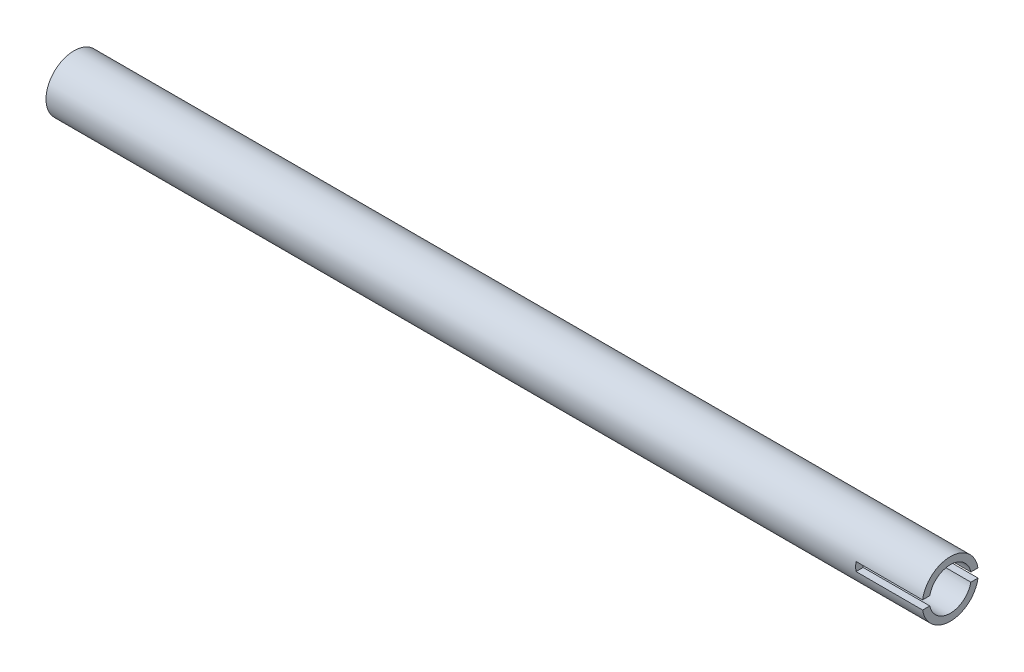
ISO-10303-21;
HEADER;
FILE_DESCRIPTION(('STEP AP214'),'2;1');
FILE_NAME('part.step','',(''),(''),'','','');
FILE_SCHEMA(('AUTOMOTIVE_DESIGN { 1 0 10303 214 1 1 1 1 }'));
ENDSEC;
DATA;
#1=APPLICATION_CONTEXT('core data for automotive mechanical design processes');
#2=APPLICATION_PROTOCOL_DEFINITION('international standard','automotive_design',2000,#1);
#3=PRODUCT_CONTEXT('',#1,'mechanical');
#4=PRODUCT('Part','Part','',(#3));
#5=PRODUCT_RELATED_PRODUCT_CATEGORY('part','',(#4));
#6=PRODUCT_DEFINITION_FORMATION('','',#4);
#7=PRODUCT_DEFINITION_CONTEXT('part definition',#1,'design');
#8=PRODUCT_DEFINITION('design','',#6,#7);
#9=PRODUCT_DEFINITION_SHAPE('','',#8);
#10=(LENGTH_UNIT() NAMED_UNIT(*) SI_UNIT(.MILLI.,.METRE.));
#11=(NAMED_UNIT(*) PLANE_ANGLE_UNIT() SI_UNIT($,.RADIAN.));
#12=(NAMED_UNIT(*) SI_UNIT($,.STERADIAN.) SOLID_ANGLE_UNIT());
#13=UNCERTAINTY_MEASURE_WITH_UNIT(LENGTH_MEASURE(1.E-05),#10,'distance_accuracy_value','');
#14=(GEOMETRIC_REPRESENTATION_CONTEXT(3) GLOBAL_UNCERTAINTY_ASSIGNED_CONTEXT((#13)) GLOBAL_UNIT_ASSIGNED_CONTEXT((#10,
#11,#12)) REPRESENTATION_CONTEXT('',''));
#15=CARTESIAN_POINT('',(0.,0.,0.));
#16=DIRECTION('',(0.,0.,1.));
#17=DIRECTION('',(1.,0.,0.));
#18=AXIS2_PLACEMENT_3D('',#15,#16,#17);
#19=CARTESIAN_POINT('',(125.,0.,0.));
#20=DIRECTION('',(1.,0.,0.));
#21=DIRECTION('',(0.,0.,-1.));
#22=AXIS2_PLACEMENT_3D('',#19,#20,#21);
#23=PLANE('',#22);
#24=DIRECTION('',(0.,0.,1.));
#25=VECTOR('',#24,1.);
#26=CARTESIAN_POINT('',(125.,-1.25,-8.));
#27=LINE('',#26,#25);
#28=CARTESIAN_POINT('',(125.,-1.25,5.86834729715275));
#29=VERTEX_POINT('',#28);
#30=CARTESIAN_POINT('',(125.,-1.25,7.90174031463955));
#31=VERTEX_POINT('',#30);
#32=EDGE_CURVE('E161',#29,#31,#27,.T.);
#33=ORIENTED_EDGE('',*,*,#32,.T.);
#34=CARTESIAN_POINT('',(125.,0.,0.));
#35=DIRECTION('',(1.,0.,0.));
#36=DIRECTION('',(0.,0.,-1.));
#37=AXIS2_PLACEMENT_3D('',#34,#35,#36);
#38=CIRCLE('',#37,8.);
#39=CARTESIAN_POINT('',(125.,-1.25,-7.90174031463955));
#40=VERTEX_POINT('',#39);
#41=EDGE_CURVE('E146',#31,#40,#38,.T.);
#42=ORIENTED_EDGE('',*,*,#41,.T.);
#43=CARTESIAN_POINT('',(125.,-1.25,-5.86834729715275));
#44=VERTEX_POINT('',#43);
#45=EDGE_CURVE('E130',#40,#44,#27,.T.);
#46=ORIENTED_EDGE('',*,*,#45,.T.);
#47=CARTESIAN_POINT('',(125.,0.,0.));
#48=DIRECTION('',(1.,0.,0.));
#49=DIRECTION('',(0.,0.,-1.));
#50=AXIS2_PLACEMENT_3D('',#47,#48,#49);
#51=CIRCLE('',#50,6.);
#52=EDGE_CURVE('E143',#29,#44,#51,.T.);
#53=ORIENTED_EDGE('',*,*,#52,.F.);
#54=EDGE_LOOP('',(#33,#42,#46,#53));
#55=FACE_BOUND('',#54,.T.);
#56=ADVANCED_FACE('F39',(#55),#23,.T.);
#57=DIRECTION('',(0.,0.,1.));
#58=VECTOR('',#57,1.);
#59=CARTESIAN_POINT('',(125.,1.25,-8.));
#60=LINE('',#59,#58);
#61=CARTESIAN_POINT('',(125.,1.25,-7.90174031463955));
#62=VERTEX_POINT('',#61);
#63=CARTESIAN_POINT('',(125.,1.25,-5.86834729715275));
#64=VERTEX_POINT('',#63);
#65=EDGE_CURVE('E62',#62,#64,#60,.T.);
#66=ORIENTED_EDGE('',*,*,#65,.F.);
#67=CARTESIAN_POINT('',(125.,1.25,7.90174031463955));
#68=VERTEX_POINT('',#67);
#69=EDGE_CURVE('E127',#62,#68,#38,.T.);
#70=ORIENTED_EDGE('',*,*,#69,.T.);
#71=CARTESIAN_POINT('',(125.,1.25,5.86834729715275));
#72=VERTEX_POINT('',#71);
#73=EDGE_CURVE('E174',#72,#68,#60,.T.);
#74=ORIENTED_EDGE('',*,*,#73,.F.);
#75=EDGE_CURVE('E139',#64,#72,#51,.T.);
#76=ORIENTED_EDGE('',*,*,#75,.F.);
#77=EDGE_LOOP('',(#66,#70,#74,#76));
#78=FACE_BOUND('',#77,.T.);
#79=ADVANCED_FACE('F180',(#78),#23,.T.);
#80=CARTESIAN_POINT('',(-125.,0.,0.));
#81=DIRECTION('',(1.,0.,0.));
#82=DIRECTION('',(0.,0.,-1.));
#83=AXIS2_PLACEMENT_3D('',#80,#81,#82);
#84=PLANE('',#83);
#85=CARTESIAN_POINT('',(-125.,0.,0.));
#86=DIRECTION('',(1.,0.,0.));
#87=DIRECTION('',(0.,0.,-1.));
#88=AXIS2_PLACEMENT_3D('',#85,#86,#87);
#89=CIRCLE('',#88,8.);
#90=CARTESIAN_POINT('',(-125.,0.,-8.));
#91=VERTEX_POINT('',#90);
#92=EDGE_CURVE('E142',#91,#91,#89,.T.);
#93=ORIENTED_EDGE('',*,*,#92,.F.);
#94=EDGE_LOOP('',(#93));
#95=FACE_BOUND('',#94,.T.);
#96=CARTESIAN_POINT('',(-125.,0.,0.));
#97=DIRECTION('',(1.,0.,0.));
#98=DIRECTION('',(0.,0.,-1.));
#99=AXIS2_PLACEMENT_3D('',#96,#97,#98);
#100=CIRCLE('',#99,6.);
#101=CARTESIAN_POINT('',(-125.,0.,-6.));
#102=VERTEX_POINT('',#101);
#103=EDGE_CURVE('E138',#102,#102,#100,.T.);
#104=ORIENTED_EDGE('',*,*,#103,.T.);
#105=EDGE_LOOP('',(#104));
#106=FACE_BOUND('',#105,.T.);
#107=ADVANCED_FACE('F199',(#95,#106),#84,.F.);
#108=CARTESIAN_POINT('',(125.,0.,0.));
#109=DIRECTION('',(-1.,0.,0.));
#110=DIRECTION('',(0.,0.,1.));
#111=AXIS2_PLACEMENT_3D('',#108,#109,#110);
#112=CYLINDRICAL_SURFACE('',#111,8.);
#113=DIRECTION('',(-1.,0.,0.));
#114=VECTOR('',#113,1.);
#115=CARTESIAN_POINT('',(125.,1.25,-7.90174031463955));
#116=LINE('',#115,#114);
#117=CARTESIAN_POINT('',(106.,1.25,-7.90174031463955));
#118=VERTEX_POINT('',#117);
#119=EDGE_CURVE('E119',#62,#118,#116,.T.);
#120=ORIENTED_EDGE('',*,*,#119,.T.);
#121=CARTESIAN_POINT('',(106.,0.,0.));
#122=DIRECTION('',(-1.,0.,0.));
#123=DIRECTION('',(0.,0.,1.));
#124=AXIS2_PLACEMENT_3D('',#121,#122,#123);
#125=CIRCLE('',#124,8.);
#126=CARTESIAN_POINT('',(106.,-1.25,-7.90174031463955));
#127=VERTEX_POINT('',#126);
#128=EDGE_CURVE('E104',#118,#127,#125,.T.);
#129=ORIENTED_EDGE('',*,*,#128,.T.);
#130=DIRECTION('',(-1.,0.,0.));
#131=VECTOR('',#130,1.);
#132=CARTESIAN_POINT('',(125.,-1.25,-7.90174031463955));
#133=LINE('',#132,#131);
#134=EDGE_CURVE('E115',#127,#40,#133,.F.);
#135=ORIENTED_EDGE('',*,*,#134,.T.);
#136=ORIENTED_EDGE('',*,*,#41,.F.);
#137=DIRECTION('',(-1.,0.,0.));
#138=VECTOR('',#137,1.);
#139=CARTESIAN_POINT('',(125.,-1.25,7.90174031463955));
#140=LINE('',#139,#138);
#141=CARTESIAN_POINT('',(106.,-1.25,7.90174031463955));
#142=VERTEX_POINT('',#141);
#143=EDGE_CURVE('E135',#31,#142,#140,.T.);
#144=ORIENTED_EDGE('',*,*,#143,.T.);
#145=CARTESIAN_POINT('',(106.,1.25,7.90174031463955));
#146=VERTEX_POINT('',#145);
#147=EDGE_CURVE('E116',#142,#146,#125,.T.);
#148=ORIENTED_EDGE('',*,*,#147,.T.);
#149=DIRECTION('',(-1.,0.,0.));
#150=VECTOR('',#149,1.);
#151=CARTESIAN_POINT('',(125.,1.25,7.90174031463955));
#152=LINE('',#151,#150);
#153=EDGE_CURVE('E128',#146,#68,#152,.F.);
#154=ORIENTED_EDGE('',*,*,#153,.T.);
#155=ORIENTED_EDGE('',*,*,#69,.F.);
#156=EDGE_LOOP('',(#120,#129,#135,#136,#144,#148,#154,#155));
#157=FACE_BOUND('',#156,.T.);
#158=ORIENTED_EDGE('',*,*,#92,.T.);
#159=EDGE_LOOP('',(#158));
#160=FACE_BOUND('',#159,.T.);
#161=ADVANCED_FACE('F41',(#157,#160),#112,.T.);
#162=CARTESIAN_POINT('',(125.,0.,0.));
#163=DIRECTION('',(-1.,0.,0.));
#164=DIRECTION('',(0.,0.,1.));
#165=AXIS2_PLACEMENT_3D('',#162,#163,#164);
#166=CYLINDRICAL_SURFACE('',#165,6.);
#167=DIRECTION('',(-1.,0.,0.));
#168=VECTOR('',#167,1.);
#169=CARTESIAN_POINT('',(125.,-1.25,-5.86834729715275));
#170=LINE('',#169,#168);
#171=CARTESIAN_POINT('',(106.,-1.25,-5.86834729715275));
#172=VERTEX_POINT('',#171);
#173=EDGE_CURVE('E11',#172,#44,#170,.F.);
#174=ORIENTED_EDGE('',*,*,#173,.F.);
#175=CARTESIAN_POINT('',(106.,0.,0.));
#176=DIRECTION('',(-1.,0.,0.));
#177=DIRECTION('',(0.,0.,1.));
#178=AXIS2_PLACEMENT_3D('',#175,#176,#177);
#179=CIRCLE('',#178,6.);
#180=CARTESIAN_POINT('',(106.,1.25,-5.86834729715275));
#181=VERTEX_POINT('',#180);
#182=EDGE_CURVE('E47',#181,#172,#179,.T.);
#183=ORIENTED_EDGE('',*,*,#182,.F.);
#184=DIRECTION('',(-1.,0.,0.));
#185=VECTOR('',#184,1.);
#186=CARTESIAN_POINT('',(125.,1.25,-5.86834729715275));
#187=LINE('',#186,#185);
#188=EDGE_CURVE('E120',#64,#181,#187,.T.);
#189=ORIENTED_EDGE('',*,*,#188,.F.);
#190=ORIENTED_EDGE('',*,*,#75,.T.);
#191=DIRECTION('',(-1.,0.,0.));
#192=VECTOR('',#191,1.);
#193=CARTESIAN_POINT('',(125.,1.25,5.86834729715275));
#194=LINE('',#193,#192);
#195=CARTESIAN_POINT('',(106.,1.25,5.86834729715275));
#196=VERTEX_POINT('',#195);
#197=EDGE_CURVE('E151',#196,#72,#194,.F.);
#198=ORIENTED_EDGE('',*,*,#197,.F.);
#199=CARTESIAN_POINT('',(106.,-1.25,5.86834729715275));
#200=VERTEX_POINT('',#199);
#201=EDGE_CURVE('E153',#200,#196,#179,.T.);
#202=ORIENTED_EDGE('',*,*,#201,.F.);
#203=DIRECTION('',(-1.,0.,0.));
#204=VECTOR('',#203,1.);
#205=CARTESIAN_POINT('',(125.,-1.25,5.86834729715275));
#206=LINE('',#205,#204);
#207=EDGE_CURVE('E155',#29,#200,#206,.T.);
#208=ORIENTED_EDGE('',*,*,#207,.F.);
#209=ORIENTED_EDGE('',*,*,#52,.T.);
#210=EDGE_LOOP('',(#174,#183,#189,#190,#198,#202,#208,#209));
#211=FACE_BOUND('',#210,.T.);
#212=ORIENTED_EDGE('',*,*,#103,.F.);
#213=EDGE_LOOP('',(#212));
#214=FACE_BOUND('',#213,.T.);
#215=ADVANCED_FACE('F164',(#211,#214),#166,.F.);
#216=CARTESIAN_POINT('',(125.,1.25,-8.));
#217=DIRECTION('',(0.,1.,0.));
#218=DIRECTION('',(-1.,0.,0.));
#219=AXIS2_PLACEMENT_3D('',#216,#217,#218);
#220=PLANE('',#219);
#221=DIRECTION('',(0.,0.,1.));
#222=VECTOR('',#221,1.);
#223=CARTESIAN_POINT('',(106.,1.25,-8.));
#224=LINE('',#223,#222);
#225=EDGE_CURVE('E54',#196,#146,#224,.T.);
#226=ORIENTED_EDGE('',*,*,#225,.F.);
#227=ORIENTED_EDGE('',*,*,#197,.T.);
#228=ORIENTED_EDGE('',*,*,#73,.T.);
#229=ORIENTED_EDGE('',*,*,#153,.F.);
#230=EDGE_LOOP('',(#226,#227,#228,#229));
#231=FACE_BOUND('',#230,.T.);
#232=ADVANCED_FACE('F176',(#231),#220,.F.);
#233=CARTESIAN_POINT('',(106.,1.25,-8.));
#234=DIRECTION('',(-1.,0.,0.));
#235=DIRECTION('',(0.,0.,1.));
#236=AXIS2_PLACEMENT_3D('',#233,#234,#235);
#237=PLANE('',#236);
#238=ORIENTED_EDGE('',*,*,#147,.F.);
#239=DIRECTION('',(0.,0.,1.));
#240=VECTOR('',#239,1.);
#241=CARTESIAN_POINT('',(106.,-1.25,-8.));
#242=LINE('',#241,#240);
#243=EDGE_CURVE('E121',#200,#142,#242,.T.);
#244=ORIENTED_EDGE('',*,*,#243,.F.);
#245=ORIENTED_EDGE('',*,*,#201,.T.);
#246=ORIENTED_EDGE('',*,*,#225,.T.);
#247=EDGE_LOOP('',(#238,#244,#245,#246));
#248=FACE_BOUND('',#247,.T.);
#249=ADVANCED_FACE('F183',(#248),#237,.F.);
#250=CARTESIAN_POINT('',(125.,-1.25,-8.));
#251=DIRECTION('',(0.,-1.,0.));
#252=DIRECTION('',(1.,0.,0.));
#253=AXIS2_PLACEMENT_3D('',#250,#251,#252);
#254=PLANE('',#253);
#255=ORIENTED_EDGE('',*,*,#32,.F.);
#256=ORIENTED_EDGE('',*,*,#207,.T.);
#257=ORIENTED_EDGE('',*,*,#243,.T.);
#258=ORIENTED_EDGE('',*,*,#143,.F.);
#259=EDGE_LOOP('',(#255,#256,#257,#258));
#260=FACE_BOUND('',#259,.T.);
#261=ADVANCED_FACE('F185',(#260),#254,.F.);
#262=EDGE_CURVE('E110',#127,#172,#242,.T.);
#263=ORIENTED_EDGE('',*,*,#262,.T.);
#264=ORIENTED_EDGE('',*,*,#173,.T.);
#265=ORIENTED_EDGE('',*,*,#45,.F.);
#266=ORIENTED_EDGE('',*,*,#134,.F.);
#267=EDGE_LOOP('',(#263,#264,#265,#266));
#268=FACE_BOUND('',#267,.T.);
#269=ADVANCED_FACE('F159',(#268),#254,.F.);
#270=EDGE_CURVE('E107',#118,#181,#224,.T.);
#271=ORIENTED_EDGE('',*,*,#270,.T.);
#272=ORIENTED_EDGE('',*,*,#182,.T.);
#273=ORIENTED_EDGE('',*,*,#262,.F.);
#274=ORIENTED_EDGE('',*,*,#128,.F.);
#275=EDGE_LOOP('',(#271,#272,#273,#274));
#276=FACE_BOUND('',#275,.T.);
#277=ADVANCED_FACE('F106',(#276),#237,.F.);
#278=ORIENTED_EDGE('',*,*,#65,.T.);
#279=ORIENTED_EDGE('',*,*,#188,.T.);
#280=ORIENTED_EDGE('',*,*,#270,.F.);
#281=ORIENTED_EDGE('',*,*,#119,.F.);
#282=EDGE_LOOP('',(#278,#279,#280,#281));
#283=FACE_BOUND('',#282,.T.);
#284=ADVANCED_FACE('F118',(#283),#220,.F.);
#285=CLOSED_SHELL('',(#56,#79,#107,#161,#215,#232,#249,#261,#269,#277,#284));
#286=MANIFOLD_SOLID_BREP('B2',#285);
#287=ADVANCED_BREP_SHAPE_REPRESENTATION('',(#18,#286),#14);
#288=SHAPE_DEFINITION_REPRESENTATION(#9,#287);
ENDSEC;
END-ISO-10303-21;
